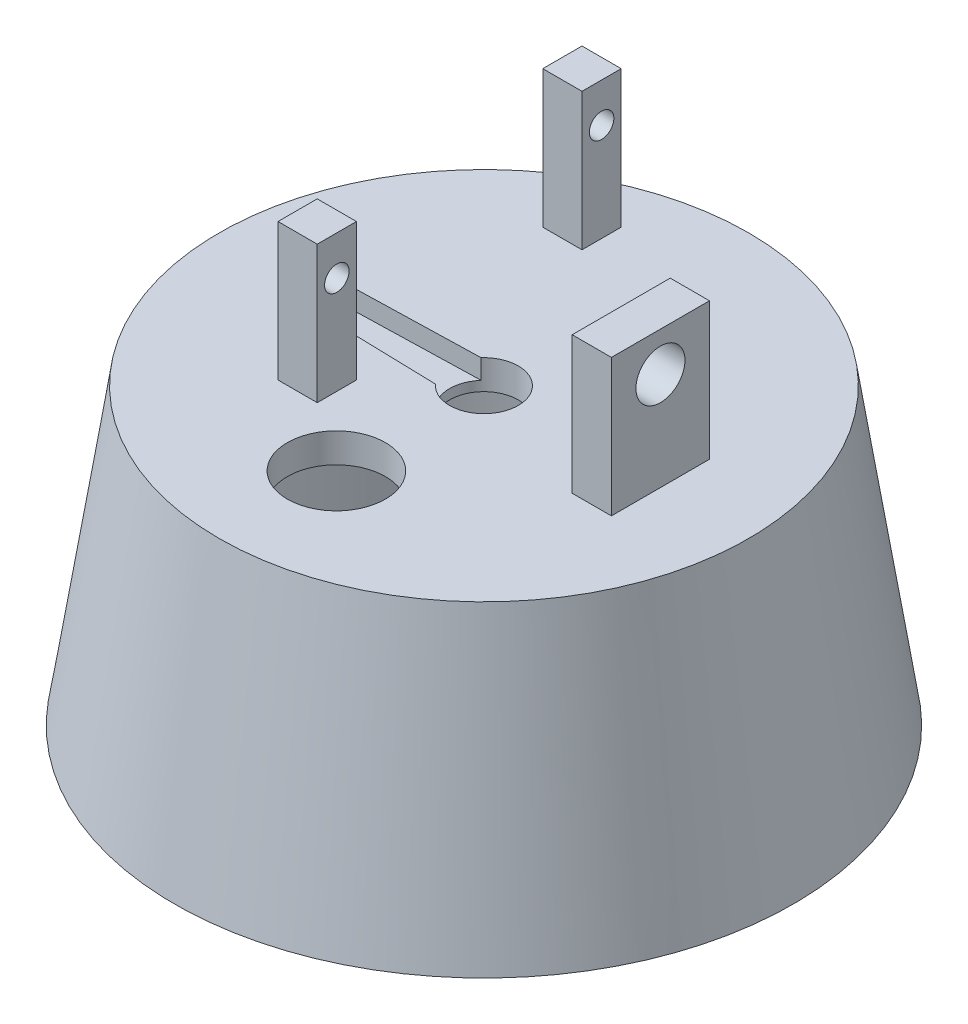
ISO-10303-21;
HEADER;
FILE_DESCRIPTION(('STEP AP214'),'2;1');
FILE_NAME('part.step','',(''),(''),'','','');
FILE_SCHEMA(('AUTOMOTIVE_DESIGN { 1 0 10303 214 1 1 1 1 }'));
ENDSEC;
DATA;
#1=APPLICATION_CONTEXT('core data for automotive mechanical design processes');
#2=APPLICATION_PROTOCOL_DEFINITION('international standard','automotive_design',2000,#1);
#3=PRODUCT_CONTEXT('',#1,'mechanical');
#4=PRODUCT('Part','Part','',(#3));
#5=PRODUCT_RELATED_PRODUCT_CATEGORY('part','',(#4));
#6=PRODUCT_DEFINITION_FORMATION('','',#4);
#7=PRODUCT_DEFINITION_CONTEXT('part definition',#1,'design');
#8=PRODUCT_DEFINITION('design','',#6,#7);
#9=PRODUCT_DEFINITION_SHAPE('','',#8);
#10=(LENGTH_UNIT() NAMED_UNIT(*) SI_UNIT(.MILLI.,.METRE.));
#11=(NAMED_UNIT(*) PLANE_ANGLE_UNIT() SI_UNIT($,.RADIAN.));
#12=(NAMED_UNIT(*) SI_UNIT($,.STERADIAN.) SOLID_ANGLE_UNIT());
#13=UNCERTAINTY_MEASURE_WITH_UNIT(LENGTH_MEASURE(1.E-05),#10,'distance_accuracy_value','');
#14=(GEOMETRIC_REPRESENTATION_CONTEXT(3) GLOBAL_UNCERTAINTY_ASSIGNED_CONTEXT((#13)) GLOBAL_UNIT_ASSIGNED_CONTEXT((#10,
#11,#12)) REPRESENTATION_CONTEXT('',''));
#15=CARTESIAN_POINT('',(0.,0.,0.));
#16=DIRECTION('',(0.,0.,1.));
#17=DIRECTION('',(1.,0.,0.));
#18=AXIS2_PLACEMENT_3D('',#15,#16,#17);
#19=CARTESIAN_POINT('',(0.,30.,0.));
#20=DIRECTION('',(0.,1.,0.));
#21=DIRECTION('',(0.,0.,1.));
#22=AXIS2_PLACEMENT_3D('',#19,#20,#21);
#23=PLANE('',#22);
#24=CARTESIAN_POINT('',(0.,30.,0.));
#25=DIRECTION('',(0.,1.,0.));
#26=DIRECTION('',(0.,0.,1.));
#27=AXIS2_PLACEMENT_3D('',#24,#25,#26);
#28=CIRCLE('',#27,3.5);
#29=CARTESIAN_POINT('',(-2.61064188469618,30.,2.3312119058271));
#30=VERTEX_POINT('',#29);
#31=CARTESIAN_POINT('',(-2.61075285255401,30.,-2.33108763088844));
#32=VERTEX_POINT('',#31);
#33=EDGE_CURVE('E194',#30,#32,#28,.T.);
#34=ORIENTED_EDGE('',*,*,#33,.F.);
#35=DIRECTION('',(0.999644381212083,0.,0.0266666666666665));
#36=VECTOR('',#35,1.);
#37=CARTESIAN_POINT('',(-0.0639999999999996,30.,2.399146514909));
#38=LINE('',#37,#36);
#39=CARTESIAN_POINT('',(-15.0533333333333,30.,1.99928876242417));
#40=VERTEX_POINT('',#39);
#41=EDGE_CURVE('E207',#40,#30,#38,.T.);
#42=ORIENTED_EDGE('',*,*,#41,.F.);
#43=CARTESIAN_POINT('',(-15.,30.,0.));
#44=DIRECTION('',(0.,1.,0.));
#45=DIRECTION('',(0.,0.,1.));
#46=AXIS2_PLACEMENT_3D('',#43,#44,#45);
#47=CIRCLE('',#46,2.);
#48=CARTESIAN_POINT('',(-15.,30.,-2.));
#49=VERTEX_POINT('',#48);
#50=EDGE_CURVE('E208',#49,#40,#47,.T.);
#51=ORIENTED_EDGE('',*,*,#50,.F.);
#52=DIRECTION('',(0.999643110687499,0.,-0.0267142519083337));
#53=VECTOR('',#52,1.);
#54=CARTESIAN_POINT('',(-0.0641142045800008,30.,-2.39914346565));
#55=LINE('',#54,#53);
#56=EDGE_CURVE('E71',#49,#32,#55,.T.);
#57=ORIENTED_EDGE('',*,*,#56,.T.);
#58=EDGE_LOOP('',(#34,#42,#51,#57));
#59=FACE_BOUND('',#58,.T.);
#60=CARTESIAN_POINT('',(0.,30.,15.0450566495924));
#61=DIRECTION('',(0.,1.,0.));
#62=DIRECTION('',(0.,0.,1.));
#63=AXIS2_PLACEMENT_3D('',#60,#61,#62);
#64=CIRCLE('',#63,5.);
#65=CARTESIAN_POINT('',(0.,30.,20.0450566495924));
#66=VERTEX_POINT('',#65);
#67=EDGE_CURVE('E212',#66,#66,#64,.T.);
#68=ORIENTED_EDGE('',*,*,#67,.F.);
#69=EDGE_LOOP('',(#68));
#70=FACE_BOUND('',#69,.T.);
#71=CARTESIAN_POINT('',(0.,30.,0.));
#72=DIRECTION('',(0.,-1.,0.));
#73=DIRECTION('',(0.,0.,-1.));
#74=AXIS2_PLACEMENT_3D('',#71,#72,#73);
#75=CIRCLE('',#74,27.);
#76=CARTESIAN_POINT('',(0.,30.,-27.));
#77=VERTEX_POINT('',#76);
#78=EDGE_CURVE('E355',#77,#77,#75,.T.);
#79=ORIENTED_EDGE('',*,*,#78,.F.);
#80=EDGE_LOOP('',(#79));
#81=FACE_BOUND('',#80,.T.);
#82=DIRECTION('',(-1.,0.,0.));
#83=VECTOR('',#82,1.);
#84=CARTESIAN_POINT('',(-7.,30.,-21.));
#85=LINE('',#84,#83);
#86=CARTESIAN_POINT('',(-7.,30.,-21.));
#87=VERTEX_POINT('',#86);
#88=CARTESIAN_POINT('',(-11.,30.,-21.));
#89=VERTEX_POINT('',#88);
#90=EDGE_CURVE('E333',#87,#89,#85,.T.);
#91=ORIENTED_EDGE('',*,*,#90,.F.);
#92=DIRECTION('',(0.,0.,-1.));
#93=VECTOR('',#92,1.);
#94=CARTESIAN_POINT('',(-7.,30.,-21.));
#95=LINE('',#94,#93);
#96=CARTESIAN_POINT('',(-7.,30.,-17.));
#97=VERTEX_POINT('',#96);
#98=EDGE_CURVE('E314',#97,#87,#95,.T.);
#99=ORIENTED_EDGE('',*,*,#98,.F.);
#100=DIRECTION('',(1.,0.,0.));
#101=VECTOR('',#100,1.);
#102=CARTESIAN_POINT('',(-7.,30.,-17.));
#103=LINE('',#102,#101);
#104=CARTESIAN_POINT('',(-11.,30.,-17.));
#105=VERTEX_POINT('',#104);
#106=EDGE_CURVE('E320',#105,#97,#103,.T.);
#107=ORIENTED_EDGE('',*,*,#106,.F.);
#108=DIRECTION('',(0.,0.,1.));
#109=VECTOR('',#108,1.);
#110=CARTESIAN_POINT('',(-11.,30.,-21.));
#111=LINE('',#110,#109);
#112=EDGE_CURVE('E336',#89,#105,#111,.T.);
#113=ORIENTED_EDGE('',*,*,#112,.F.);
#114=EDGE_LOOP('',(#91,#99,#107,#113));
#115=FACE_BOUND('',#114,.T.);
#116=DIRECTION('',(1.,0.,0.));
#117=VECTOR('',#116,1.);
#118=CARTESIAN_POINT('',(-11.,30.,10.));
#119=LINE('',#118,#117);
#120=CARTESIAN_POINT('',(-11.,30.,10.));
#121=VERTEX_POINT('',#120);
#122=CARTESIAN_POINT('',(-7.,30.,10.));
#123=VERTEX_POINT('',#122);
#124=EDGE_CURVE('E292',#121,#123,#119,.T.);
#125=ORIENTED_EDGE('',*,*,#124,.F.);
#126=DIRECTION('',(0.,0.,1.));
#127=VECTOR('',#126,1.);
#128=CARTESIAN_POINT('',(-11.,30.,6.));
#129=LINE('',#128,#127);
#130=CARTESIAN_POINT('',(-11.,30.,6.));
#131=VERTEX_POINT('',#130);
#132=EDGE_CURVE('E288',#131,#121,#129,.T.);
#133=ORIENTED_EDGE('',*,*,#132,.F.);
#134=DIRECTION('',(-1.,0.,0.));
#135=VECTOR('',#134,1.);
#136=CARTESIAN_POINT('',(-11.,30.,6.));
#137=LINE('',#136,#135);
#138=CARTESIAN_POINT('',(-7.,30.,6.));
#139=VERTEX_POINT('',#138);
#140=EDGE_CURVE('E278',#139,#131,#137,.T.);
#141=ORIENTED_EDGE('',*,*,#140,.F.);
#142=DIRECTION('',(0.,0.,-1.));
#143=VECTOR('',#142,1.);
#144=CARTESIAN_POINT('',(-7.,30.,6.));
#145=LINE('',#144,#143);
#146=EDGE_CURVE('E295',#123,#139,#145,.T.);
#147=ORIENTED_EDGE('',*,*,#146,.F.);
#148=EDGE_LOOP('',(#125,#133,#141,#147));
#149=FACE_BOUND('',#148,.T.);
#150=DIRECTION('',(-1.,0.,0.));
#151=VECTOR('',#150,1.);
#152=CARTESIAN_POINT('',(14.,30.,-5.));
#153=LINE('',#152,#151);
#154=CARTESIAN_POINT('',(18.,30.,-5.));
#155=VERTEX_POINT('',#154);
#156=CARTESIAN_POINT('',(14.,30.,-5.));
#157=VERTEX_POINT('',#156);
#158=EDGE_CURVE('E240',#155,#157,#153,.T.);
#159=ORIENTED_EDGE('',*,*,#158,.F.);
#160=DIRECTION('',(0.,0.,-1.));
#161=VECTOR('',#160,1.);
#162=CARTESIAN_POINT('',(18.,30.,5.));
#163=LINE('',#162,#161);
#164=CARTESIAN_POINT('',(18.,30.,5.));
#165=VERTEX_POINT('',#164);
#166=EDGE_CURVE('E236',#165,#155,#163,.T.);
#167=ORIENTED_EDGE('',*,*,#166,.F.);
#168=DIRECTION('',(1.,0.,0.));
#169=VECTOR('',#168,1.);
#170=CARTESIAN_POINT('',(14.,30.,5.));
#171=LINE('',#170,#169);
#172=CARTESIAN_POINT('',(14.,30.,5.));
#173=VERTEX_POINT('',#172);
#174=EDGE_CURVE('E226',#173,#165,#171,.T.);
#175=ORIENTED_EDGE('',*,*,#174,.F.);
#176=DIRECTION('',(0.,0.,1.));
#177=VECTOR('',#176,1.);
#178=CARTESIAN_POINT('',(14.,30.,5.));
#179=LINE('',#178,#177);
#180=EDGE_CURVE('E243',#157,#173,#179,.T.);
#181=ORIENTED_EDGE('',*,*,#180,.F.);
#182=EDGE_LOOP('',(#159,#167,#175,#181));
#183=FACE_BOUND('',#182,.T.);
#184=ADVANCED_FACE('F53',(#59,#70,#81,#115,#149,#183),#23,.T.);
#185=CARTESIAN_POINT('',(0.,0.,0.));
#186=DIRECTION('',(0.,1.,0.));
#187=DIRECTION('',(0.,0.,1.));
#188=AXIS2_PLACEMENT_3D('',#185,#186,#187);
#189=PLANE('',#188);
#190=CARTESIAN_POINT('',(0.,0.,0.));
#191=DIRECTION('',(0.,1.,0.));
#192=DIRECTION('',(0.,0.,1.));
#193=AXIS2_PLACEMENT_3D('',#190,#191,#192);
#194=CIRCLE('',#193,25.25);
#195=CARTESIAN_POINT('',(0.,0.,25.25));
#196=VERTEX_POINT('',#195);
#197=EDGE_CURVE('E12',#196,#196,#194,.T.);
#198=ORIENTED_EDGE('',*,*,#197,.T.);
#199=EDGE_LOOP('',(#198));
#200=FACE_BOUND('',#199,.T.);
#201=CARTESIAN_POINT('',(0.,0.,0.));
#202=DIRECTION('',(0.,-1.,0.));
#203=DIRECTION('',(0.,0.,-1.));
#204=AXIS2_PLACEMENT_3D('',#201,#202,#203);
#205=CIRCLE('',#204,31.5640277877834);
#206=CARTESIAN_POINT('',(0.,0.,-31.5640277877834));
#207=VERTEX_POINT('',#206);
#208=EDGE_CURVE('E359',#207,#207,#205,.T.);
#209=ORIENTED_EDGE('',*,*,#208,.T.);
#210=EDGE_LOOP('',(#209));
#211=FACE_BOUND('',#210,.T.);
#212=ADVANCED_FACE('F55',(#200,#211),#189,.F.);
#213=CARTESIAN_POINT('',(0.,27.,0.));
#214=DIRECTION('',(0.,-1.,0.));
#215=DIRECTION('',(0.,0.,-1.));
#216=AXIS2_PLACEMENT_3D('',#213,#214,#215);
#217=CYLINDRICAL_SURFACE('',#216,25.25);
#218=CARTESIAN_POINT('',(0.,27.,0.));
#219=DIRECTION('',(0.,1.,0.));
#220=DIRECTION('',(0.,0.,1.));
#221=AXIS2_PLACEMENT_3D('',#218,#219,#220);
#222=CIRCLE('',#221,25.25);
#223=CARTESIAN_POINT('',(0.,27.,25.25));
#224=VERTEX_POINT('',#223);
#225=EDGE_CURVE('E63',#224,#224,#222,.T.);
#226=ORIENTED_EDGE('',*,*,#225,.T.);
#227=EDGE_LOOP('',(#226));
#228=FACE_BOUND('',#227,.T.);
#229=ORIENTED_EDGE('',*,*,#197,.F.);
#230=EDGE_LOOP('',(#229));
#231=FACE_BOUND('',#230,.T.);
#232=ADVANCED_FACE('F400',(#228,#231),#217,.F.);
#233=CARTESIAN_POINT('',(0.,27.,0.));
#234=DIRECTION('',(0.,1.,0.));
#235=DIRECTION('',(0.,0.,1.));
#236=AXIS2_PLACEMENT_3D('',#233,#234,#235);
#237=PLANE('',#236);
#238=CARTESIAN_POINT('',(0.,27.,0.));
#239=DIRECTION('',(0.,1.,0.));
#240=DIRECTION('',(0.,0.,1.));
#241=AXIS2_PLACEMENT_3D('',#238,#239,#240);
#242=CIRCLE('',#241,3.5);
#243=CARTESIAN_POINT('',(0.,27.,3.5));
#244=VERTEX_POINT('',#243);
#245=EDGE_CURVE('E181',#244,#244,#242,.T.);
#246=ORIENTED_EDGE('',*,*,#245,.T.);
#247=EDGE_LOOP('',(#246));
#248=FACE_BOUND('',#247,.T.);
#249=CARTESIAN_POINT('',(0.,27.,15.0450566495924));
#250=DIRECTION('',(0.,1.,0.));
#251=DIRECTION('',(0.,0.,1.));
#252=AXIS2_PLACEMENT_3D('',#249,#250,#251);
#253=CIRCLE('',#252,5.);
#254=CARTESIAN_POINT('',(0.,27.,20.0450566495924));
#255=VERTEX_POINT('',#254);
#256=EDGE_CURVE('E57',#255,#255,#253,.T.);
#257=ORIENTED_EDGE('',*,*,#256,.T.);
#258=EDGE_LOOP('',(#257));
#259=FACE_BOUND('',#258,.T.);
#260=ORIENTED_EDGE('',*,*,#225,.F.);
#261=EDGE_LOOP('',(#260));
#262=FACE_BOUND('',#261,.T.);
#263=ADVANCED_FACE('F407',(#248,#259,#262),#237,.F.);
#264=CARTESIAN_POINT('',(0.,0.,0.));
#265=DIRECTION('',(0.,-1.,0.));
#266=DIRECTION('',(0.,0.,-1.));
#267=AXIS2_PLACEMENT_3D('',#264,#265,#266);
#268=CONICAL_SURFACE('',#267,31.5640277877834,0.15097658671051);
#269=ORIENTED_EDGE('',*,*,#78,.T.);
#270=EDGE_LOOP('',(#269));
#271=FACE_BOUND('',#270,.T.);
#272=ORIENTED_EDGE('',*,*,#208,.F.);
#273=EDGE_LOOP('',(#272));
#274=FACE_BOUND('',#273,.T.);
#275=ADVANCED_FACE('F405',(#271,#274),#268,.T.);
#276=CARTESIAN_POINT('',(-7.,44.,-21.));
#277=DIRECTION('',(-1.,0.,0.));
#278=DIRECTION('',(0.,0.,1.));
#279=AXIS2_PLACEMENT_3D('',#276,#277,#278);
#280=PLANE('',#279);
#281=CARTESIAN_POINT('',(-7.,40.,-19.));
#282=DIRECTION('',(1.,0.,0.));
#283=DIRECTION('',(0.,0.,-1.));
#284=AXIS2_PLACEMENT_3D('',#281,#282,#283);
#285=CIRCLE('',#284,1.25);
#286=CARTESIAN_POINT('',(-7.,40.,-20.25));
#287=VERTEX_POINT('',#286);
#288=EDGE_CURVE('E260',#287,#287,#285,.T.);
#289=ORIENTED_EDGE('',*,*,#288,.F.);
#290=EDGE_LOOP('',(#289));
#291=FACE_BOUND('',#290,.T.);
#292=ORIENTED_EDGE('',*,*,#98,.T.);
#293=DIRECTION('',(0.,-1.,0.));
#294=VECTOR('',#293,1.);
#295=CARTESIAN_POINT('',(-7.,44.,-21.));
#296=LINE('',#295,#294);
#297=CARTESIAN_POINT('',(-7.,44.,-21.));
#298=VERTEX_POINT('',#297);
#299=EDGE_CURVE('E352',#298,#87,#296,.T.);
#300=ORIENTED_EDGE('',*,*,#299,.F.);
#301=DIRECTION('',(0.,0.,-1.));
#302=VECTOR('',#301,1.);
#303=CARTESIAN_POINT('',(-7.,44.,-21.));
#304=LINE('',#303,#302);
#305=CARTESIAN_POINT('',(-7.,44.,-17.));
#306=VERTEX_POINT('',#305);
#307=EDGE_CURVE('E315',#306,#298,#304,.T.);
#308=ORIENTED_EDGE('',*,*,#307,.F.);
#309=DIRECTION('',(0.,-1.,0.));
#310=VECTOR('',#309,1.);
#311=CARTESIAN_POINT('',(-7.,44.,-17.));
#312=LINE('',#311,#310);
#313=EDGE_CURVE('E329',#306,#97,#312,.T.);
#314=ORIENTED_EDGE('',*,*,#313,.T.);
#315=EDGE_LOOP('',(#292,#300,#308,#314));
#316=FACE_BOUND('',#315,.T.);
#317=ADVANCED_FACE('F422',(#291,#316),#280,.F.);
#318=CARTESIAN_POINT('',(-7.,44.,-21.));
#319=DIRECTION('',(0.,0.,1.));
#320=DIRECTION('',(1.,0.,0.));
#321=AXIS2_PLACEMENT_3D('',#318,#319,#320);
#322=PLANE('',#321);
#323=ORIENTED_EDGE('',*,*,#90,.T.);
#324=DIRECTION('',(0.,-1.,0.));
#325=VECTOR('',#324,1.);
#326=CARTESIAN_POINT('',(-11.,44.,-21.));
#327=LINE('',#326,#325);
#328=CARTESIAN_POINT('',(-11.,44.,-21.));
#329=VERTEX_POINT('',#328);
#330=EDGE_CURVE('E348',#329,#89,#327,.T.);
#331=ORIENTED_EDGE('',*,*,#330,.F.);
#332=DIRECTION('',(-1.,0.,0.));
#333=VECTOR('',#332,1.);
#334=CARTESIAN_POINT('',(-7.,44.,-21.));
#335=LINE('',#334,#333);
#336=EDGE_CURVE('E319',#298,#329,#335,.T.);
#337=ORIENTED_EDGE('',*,*,#336,.F.);
#338=ORIENTED_EDGE('',*,*,#299,.T.);
#339=EDGE_LOOP('',(#323,#331,#337,#338));
#340=FACE_BOUND('',#339,.T.);
#341=ADVANCED_FACE('F427',(#340),#322,.F.);
#342=CARTESIAN_POINT('',(-11.,44.,-21.));
#343=DIRECTION('',(1.,0.,0.));
#344=DIRECTION('',(0.,0.,-1.));
#345=AXIS2_PLACEMENT_3D('',#342,#343,#344);
#346=PLANE('',#345);
#347=CARTESIAN_POINT('',(-11.,40.,-19.));
#348=DIRECTION('',(1.,0.,0.));
#349=DIRECTION('',(0.,0.,-1.));
#350=AXIS2_PLACEMENT_3D('',#347,#348,#349);
#351=CIRCLE('',#350,1.25);
#352=CARTESIAN_POINT('',(-11.,40.,-20.25));
#353=VERTEX_POINT('',#352);
#354=EDGE_CURVE('E272',#353,#353,#351,.T.);
#355=ORIENTED_EDGE('',*,*,#354,.T.);
#356=EDGE_LOOP('',(#355));
#357=FACE_BOUND('',#356,.T.);
#358=ORIENTED_EDGE('',*,*,#112,.T.);
#359=DIRECTION('',(0.,-1.,0.));
#360=VECTOR('',#359,1.);
#361=CARTESIAN_POINT('',(-11.,44.,-17.));
#362=LINE('',#361,#360);
#363=CARTESIAN_POINT('',(-11.,44.,-17.));
#364=VERTEX_POINT('',#363);
#365=EDGE_CURVE('E345',#364,#105,#362,.T.);
#366=ORIENTED_EDGE('',*,*,#365,.F.);
#367=DIRECTION('',(0.,0.,1.));
#368=VECTOR('',#367,1.);
#369=CARTESIAN_POINT('',(-11.,44.,-21.));
#370=LINE('',#369,#368);
#371=EDGE_CURVE('E323',#329,#364,#370,.T.);
#372=ORIENTED_EDGE('',*,*,#371,.F.);
#373=ORIENTED_EDGE('',*,*,#330,.T.);
#374=EDGE_LOOP('',(#358,#366,#372,#373));
#375=FACE_BOUND('',#374,.T.);
#376=ADVANCED_FACE('F500',(#357,#375),#346,.F.);
#377=CARTESIAN_POINT('',(-7.,44.,-17.));
#378=DIRECTION('',(0.,0.,-1.));
#379=DIRECTION('',(-1.,0.,0.));
#380=AXIS2_PLACEMENT_3D('',#377,#378,#379);
#381=PLANE('',#380);
#382=ORIENTED_EDGE('',*,*,#106,.T.);
#383=ORIENTED_EDGE('',*,*,#313,.F.);
#384=DIRECTION('',(1.,0.,0.));
#385=VECTOR('',#384,1.);
#386=CARTESIAN_POINT('',(-7.,44.,-17.));
#387=LINE('',#386,#385);
#388=EDGE_CURVE('E326',#364,#306,#387,.T.);
#389=ORIENTED_EDGE('',*,*,#388,.F.);
#390=ORIENTED_EDGE('',*,*,#365,.T.);
#391=EDGE_LOOP('',(#382,#383,#389,#390));
#392=FACE_BOUND('',#391,.T.);
#393=ADVANCED_FACE('F496',(#392),#381,.F.);
#394=CARTESIAN_POINT('',(0.,44.,0.));
#395=DIRECTION('',(0.,-1.,0.));
#396=DIRECTION('',(0.,0.,-1.));
#397=AXIS2_PLACEMENT_3D('',#394,#395,#396);
#398=PLANE('',#397);
#399=ORIENTED_EDGE('',*,*,#307,.T.);
#400=ORIENTED_EDGE('',*,*,#336,.T.);
#401=ORIENTED_EDGE('',*,*,#371,.T.);
#402=ORIENTED_EDGE('',*,*,#388,.T.);
#403=EDGE_LOOP('',(#399,#400,#401,#402));
#404=FACE_BOUND('',#403,.T.);
#405=ADVANCED_FACE('F492',(#404),#398,.F.);
#406=CARTESIAN_POINT('',(-11.,44.,6.));
#407=DIRECTION('',(1.,0.,0.));
#408=DIRECTION('',(0.,0.,-1.));
#409=AXIS2_PLACEMENT_3D('',#406,#407,#408);
#410=PLANE('',#409);
#411=CARTESIAN_POINT('',(-11.,40.,8.));
#412=DIRECTION('',(1.,0.,0.));
#413=DIRECTION('',(0.,0.,-1.));
#414=AXIS2_PLACEMENT_3D('',#411,#412,#413);
#415=CIRCLE('',#414,1.25);
#416=CARTESIAN_POINT('',(-11.,40.,6.75));
#417=VERTEX_POINT('',#416);
#418=EDGE_CURVE('E265',#417,#417,#415,.T.);
#419=ORIENTED_EDGE('',*,*,#418,.T.);
#420=EDGE_LOOP('',(#419));
#421=FACE_BOUND('',#420,.T.);
#422=ORIENTED_EDGE('',*,*,#132,.T.);
#423=DIRECTION('',(0.,-1.,0.));
#424=VECTOR('',#423,1.);
#425=CARTESIAN_POINT('',(-11.,44.,10.));
#426=LINE('',#425,#424);
#427=CARTESIAN_POINT('',(-11.,44.,10.));
#428=VERTEX_POINT('',#427);
#429=EDGE_CURVE('E311',#428,#121,#426,.T.);
#430=ORIENTED_EDGE('',*,*,#429,.F.);
#431=DIRECTION('',(0.,0.,1.));
#432=VECTOR('',#431,1.);
#433=CARTESIAN_POINT('',(-11.,44.,6.));
#434=LINE('',#433,#432);
#435=CARTESIAN_POINT('',(-11.,44.,6.));
#436=VERTEX_POINT('',#435);
#437=EDGE_CURVE('E273',#436,#428,#434,.T.);
#438=ORIENTED_EDGE('',*,*,#437,.F.);
#439=DIRECTION('',(0.,-1.,0.));
#440=VECTOR('',#439,1.);
#441=CARTESIAN_POINT('',(-11.,44.,6.));
#442=LINE('',#441,#440);
#443=EDGE_CURVE('E287',#436,#131,#442,.T.);
#444=ORIENTED_EDGE('',*,*,#443,.T.);
#445=EDGE_LOOP('',(#422,#430,#438,#444));
#446=FACE_BOUND('',#445,.T.);
#447=ADVANCED_FACE('F488',(#421,#446),#410,.F.);
#448=CARTESIAN_POINT('',(-11.,44.,10.));
#449=DIRECTION('',(0.,0.,-1.));
#450=DIRECTION('',(-1.,0.,0.));
#451=AXIS2_PLACEMENT_3D('',#448,#449,#450);
#452=PLANE('',#451);
#453=ORIENTED_EDGE('',*,*,#124,.T.);
#454=DIRECTION('',(0.,-1.,0.));
#455=VECTOR('',#454,1.);
#456=CARTESIAN_POINT('',(-7.,44.,10.));
#457=LINE('',#456,#455);
#458=CARTESIAN_POINT('',(-7.,44.,10.));
#459=VERTEX_POINT('',#458);
#460=EDGE_CURVE('E307',#459,#123,#457,.T.);
#461=ORIENTED_EDGE('',*,*,#460,.F.);
#462=DIRECTION('',(1.,0.,0.));
#463=VECTOR('',#462,1.);
#464=CARTESIAN_POINT('',(-11.,44.,10.));
#465=LINE('',#464,#463);
#466=EDGE_CURVE('E277',#428,#459,#465,.T.);
#467=ORIENTED_EDGE('',*,*,#466,.F.);
#468=ORIENTED_EDGE('',*,*,#429,.T.);
#469=EDGE_LOOP('',(#453,#461,#467,#468));
#470=FACE_BOUND('',#469,.T.);
#471=ADVANCED_FACE('F484',(#470),#452,.F.);
#472=CARTESIAN_POINT('',(-7.,44.,6.));
#473=DIRECTION('',(-1.,0.,0.));
#474=DIRECTION('',(0.,0.,1.));
#475=AXIS2_PLACEMENT_3D('',#472,#473,#474);
#476=PLANE('',#475);
#477=CARTESIAN_POINT('',(-7.,40.,8.));
#478=DIRECTION('',(1.,0.,0.));
#479=DIRECTION('',(0.,0.,-1.));
#480=AXIS2_PLACEMENT_3D('',#477,#478,#479);
#481=CIRCLE('',#480,1.25);
#482=CARTESIAN_POINT('',(-7.,40.,6.75));
#483=VERTEX_POINT('',#482);
#484=EDGE_CURVE('E261',#483,#483,#481,.T.);
#485=ORIENTED_EDGE('',*,*,#484,.F.);
#486=EDGE_LOOP('',(#485));
#487=FACE_BOUND('',#486,.T.);
#488=ORIENTED_EDGE('',*,*,#146,.T.);
#489=DIRECTION('',(0.,-1.,0.));
#490=VECTOR('',#489,1.);
#491=CARTESIAN_POINT('',(-7.,44.,6.));
#492=LINE('',#491,#490);
#493=CARTESIAN_POINT('',(-7.,44.,6.));
#494=VERTEX_POINT('',#493);
#495=EDGE_CURVE('E304',#494,#139,#492,.T.);
#496=ORIENTED_EDGE('',*,*,#495,.F.);
#497=DIRECTION('',(0.,0.,-1.));
#498=VECTOR('',#497,1.);
#499=CARTESIAN_POINT('',(-7.,44.,6.));
#500=LINE('',#499,#498);
#501=EDGE_CURVE('E281',#459,#494,#500,.T.);
#502=ORIENTED_EDGE('',*,*,#501,.F.);
#503=ORIENTED_EDGE('',*,*,#460,.T.);
#504=EDGE_LOOP('',(#488,#496,#502,#503));
#505=FACE_BOUND('',#504,.T.);
#506=ADVANCED_FACE('F480',(#487,#505),#476,.F.);
#507=CARTESIAN_POINT('',(-11.,44.,6.));
#508=DIRECTION('',(0.,0.,1.));
#509=DIRECTION('',(1.,0.,0.));
#510=AXIS2_PLACEMENT_3D('',#507,#508,#509);
#511=PLANE('',#510);
#512=ORIENTED_EDGE('',*,*,#140,.T.);
#513=ORIENTED_EDGE('',*,*,#443,.F.);
#514=DIRECTION('',(-1.,0.,0.));
#515=VECTOR('',#514,1.);
#516=CARTESIAN_POINT('',(-11.,44.,6.));
#517=LINE('',#516,#515);
#518=EDGE_CURVE('E284',#494,#436,#517,.T.);
#519=ORIENTED_EDGE('',*,*,#518,.F.);
#520=ORIENTED_EDGE('',*,*,#495,.T.);
#521=EDGE_LOOP('',(#512,#513,#519,#520));
#522=FACE_BOUND('',#521,.T.);
#523=ADVANCED_FACE('F476',(#522),#511,.F.);
#524=CARTESIAN_POINT('',(0.,44.,0.));
#525=DIRECTION('',(0.,1.,0.));
#526=DIRECTION('',(0.,0.,1.));
#527=AXIS2_PLACEMENT_3D('',#524,#525,#526);
#528=PLANE('',#527);
#529=ORIENTED_EDGE('',*,*,#437,.T.);
#530=ORIENTED_EDGE('',*,*,#466,.T.);
#531=ORIENTED_EDGE('',*,*,#501,.T.);
#532=ORIENTED_EDGE('',*,*,#518,.T.);
#533=EDGE_LOOP('',(#529,#530,#531,#532));
#534=FACE_BOUND('',#533,.T.);
#535=ADVANCED_FACE('F469',(#534),#528,.T.);
#536=CARTESIAN_POINT('',(-21.,40.,8.));
#537=DIRECTION('',(1.,0.,0.));
#538=DIRECTION('',(0.,0.,-1.));
#539=AXIS2_PLACEMENT_3D('',#536,#537,#538);
#540=CYLINDRICAL_SURFACE('',#539,1.25);
#541=ORIENTED_EDGE('',*,*,#484,.T.);
#542=EDGE_LOOP('',(#541));
#543=FACE_BOUND('',#542,.T.);
#544=ORIENTED_EDGE('',*,*,#418,.F.);
#545=EDGE_LOOP('',(#544));
#546=FACE_BOUND('',#545,.T.);
#547=ADVANCED_FACE('F466',(#543,#546),#540,.F.);
#548=CARTESIAN_POINT('',(-21.,40.,-19.));
#549=DIRECTION('',(1.,0.,0.));
#550=DIRECTION('',(0.,0.,-1.));
#551=AXIS2_PLACEMENT_3D('',#548,#549,#550);
#552=CYLINDRICAL_SURFACE('',#551,1.25);
#553=ORIENTED_EDGE('',*,*,#288,.T.);
#554=EDGE_LOOP('',(#553));
#555=FACE_BOUND('',#554,.T.);
#556=ORIENTED_EDGE('',*,*,#354,.F.);
#557=EDGE_LOOP('',(#556));
#558=FACE_BOUND('',#557,.T.);
#559=ADVANCED_FACE('F464',(#555,#558),#552,.F.);
#560=CARTESIAN_POINT('',(18.,44.,5.));
#561=DIRECTION('',(-1.,0.,0.));
#562=DIRECTION('',(0.,0.,1.));
#563=AXIS2_PLACEMENT_3D('',#560,#561,#562);
#564=PLANE('',#563);
#565=CARTESIAN_POINT('',(18.,40.,0.));
#566=DIRECTION('',(1.,0.,0.));
#567=DIRECTION('',(0.,0.,-1.));
#568=AXIS2_PLACEMENT_3D('',#565,#566,#567);
#569=CIRCLE('',#568,2.5);
#570=CARTESIAN_POINT('',(18.,40.,-2.5));
#571=VERTEX_POINT('',#570);
#572=EDGE_CURVE('E216',#571,#571,#569,.T.);
#573=ORIENTED_EDGE('',*,*,#572,.F.);
#574=EDGE_LOOP('',(#573));
#575=FACE_BOUND('',#574,.T.);
#576=ORIENTED_EDGE('',*,*,#166,.T.);
#577=DIRECTION('',(0.,-1.,0.));
#578=VECTOR('',#577,1.);
#579=CARTESIAN_POINT('',(18.,44.,-5.));
#580=LINE('',#579,#578);
#581=CARTESIAN_POINT('',(18.,44.,-5.));
#582=VERTEX_POINT('',#581);
#583=EDGE_CURVE('E257',#582,#155,#580,.T.);
#584=ORIENTED_EDGE('',*,*,#583,.F.);
#585=DIRECTION('',(0.,0.,-1.));
#586=VECTOR('',#585,1.);
#587=CARTESIAN_POINT('',(18.,44.,5.));
#588=LINE('',#587,#586);
#589=CARTESIAN_POINT('',(18.,44.,5.));
#590=VERTEX_POINT('',#589);
#591=EDGE_CURVE('E221',#590,#582,#588,.T.);
#592=ORIENTED_EDGE('',*,*,#591,.F.);
#593=DIRECTION('',(0.,-1.,0.));
#594=VECTOR('',#593,1.);
#595=CARTESIAN_POINT('',(18.,44.,5.));
#596=LINE('',#595,#594);
#597=EDGE_CURVE('E235',#590,#165,#596,.T.);
#598=ORIENTED_EDGE('',*,*,#597,.T.);
#599=EDGE_LOOP('',(#576,#584,#592,#598));
#600=FACE_BOUND('',#599,.T.);
#601=ADVANCED_FACE('F452',(#575,#600),#564,.F.);
#602=CARTESIAN_POINT('',(14.,44.,-5.));
#603=DIRECTION('',(0.,0.,1.));
#604=DIRECTION('',(1.,0.,0.));
#605=AXIS2_PLACEMENT_3D('',#602,#603,#604);
#606=PLANE('',#605);
#607=ORIENTED_EDGE('',*,*,#158,.T.);
#608=DIRECTION('',(0.,-1.,0.));
#609=VECTOR('',#608,1.);
#610=CARTESIAN_POINT('',(14.,44.,-5.));
#611=LINE('',#610,#609);
#612=CARTESIAN_POINT('',(14.,44.,-5.));
#613=VERTEX_POINT('',#612);
#614=EDGE_CURVE('E253',#613,#157,#611,.T.);
#615=ORIENTED_EDGE('',*,*,#614,.F.);
#616=DIRECTION('',(-1.,0.,0.));
#617=VECTOR('',#616,1.);
#618=CARTESIAN_POINT('',(14.,44.,-5.));
#619=LINE('',#618,#617);
#620=EDGE_CURVE('E225',#582,#613,#619,.T.);
#621=ORIENTED_EDGE('',*,*,#620,.F.);
#622=ORIENTED_EDGE('',*,*,#583,.T.);
#623=EDGE_LOOP('',(#607,#615,#621,#622));
#624=FACE_BOUND('',#623,.T.);
#625=ADVANCED_FACE('F446',(#624),#606,.F.);
#626=CARTESIAN_POINT('',(14.,44.,5.));
#627=DIRECTION('',(1.,0.,0.));
#628=DIRECTION('',(0.,0.,-1.));
#629=AXIS2_PLACEMENT_3D('',#626,#627,#628);
#630=PLANE('',#629);
#631=CARTESIAN_POINT('',(14.,40.,0.));
#632=DIRECTION('',(1.,0.,0.));
#633=DIRECTION('',(0.,0.,-1.));
#634=AXIS2_PLACEMENT_3D('',#631,#632,#633);
#635=CIRCLE('',#634,2.5);
#636=CARTESIAN_POINT('',(14.,40.,-2.5));
#637=VERTEX_POINT('',#636);
#638=EDGE_CURVE('E220',#637,#637,#635,.T.);
#639=ORIENTED_EDGE('',*,*,#638,.T.);
#640=EDGE_LOOP('',(#639));
#641=FACE_BOUND('',#640,.T.);
#642=ORIENTED_EDGE('',*,*,#180,.T.);
#643=DIRECTION('',(0.,-1.,0.));
#644=VECTOR('',#643,1.);
#645=CARTESIAN_POINT('',(14.,44.,5.));
#646=LINE('',#645,#644);
#647=CARTESIAN_POINT('',(14.,44.,5.));
#648=VERTEX_POINT('',#647);
#649=EDGE_CURVE('E79',#648,#173,#646,.T.);
#650=ORIENTED_EDGE('',*,*,#649,.F.);
#651=DIRECTION('',(0.,0.,1.));
#652=VECTOR('',#651,1.);
#653=CARTESIAN_POINT('',(14.,44.,5.));
#654=LINE('',#653,#652);
#655=EDGE_CURVE('E229',#613,#648,#654,.T.);
#656=ORIENTED_EDGE('',*,*,#655,.F.);
#657=ORIENTED_EDGE('',*,*,#614,.T.);
#658=EDGE_LOOP('',(#642,#650,#656,#657));
#659=FACE_BOUND('',#658,.T.);
#660=ADVANCED_FACE('F372',(#641,#659),#630,.F.);
#661=CARTESIAN_POINT('',(14.,44.,5.));
#662=DIRECTION('',(0.,0.,-1.));
#663=DIRECTION('',(-1.,0.,0.));
#664=AXIS2_PLACEMENT_3D('',#661,#662,#663);
#665=PLANE('',#664);
#666=ORIENTED_EDGE('',*,*,#174,.T.);
#667=ORIENTED_EDGE('',*,*,#597,.F.);
#668=DIRECTION('',(1.,0.,0.));
#669=VECTOR('',#668,1.);
#670=CARTESIAN_POINT('',(14.,44.,5.));
#671=LINE('',#670,#669);
#672=EDGE_CURVE('E232',#648,#590,#671,.T.);
#673=ORIENTED_EDGE('',*,*,#672,.F.);
#674=ORIENTED_EDGE('',*,*,#649,.T.);
#675=EDGE_LOOP('',(#666,#667,#673,#674));
#676=FACE_BOUND('',#675,.T.);
#677=ADVANCED_FACE('F389',(#676),#665,.F.);
#678=CARTESIAN_POINT('',(0.,44.,0.));
#679=DIRECTION('',(0.,-1.,0.));
#680=DIRECTION('',(0.,0.,-1.));
#681=AXIS2_PLACEMENT_3D('',#678,#679,#680);
#682=PLANE('',#681);
#683=ORIENTED_EDGE('',*,*,#591,.T.);
#684=ORIENTED_EDGE('',*,*,#620,.T.);
#685=ORIENTED_EDGE('',*,*,#655,.T.);
#686=ORIENTED_EDGE('',*,*,#672,.T.);
#687=EDGE_LOOP('',(#683,#684,#685,#686));
#688=FACE_BOUND('',#687,.T.);
#689=ADVANCED_FACE('F378',(#688),#682,.F.);
#690=CARTESIAN_POINT('',(3.99999999999999,40.,0.));
#691=DIRECTION('',(1.,0.,0.));
#692=DIRECTION('',(0.,0.,-1.));
#693=AXIS2_PLACEMENT_3D('',#690,#691,#692);
#694=CYLINDRICAL_SURFACE('',#693,2.5);
#695=ORIENTED_EDGE('',*,*,#572,.T.);
#696=EDGE_LOOP('',(#695));
#697=FACE_BOUND('',#696,.T.);
#698=ORIENTED_EDGE('',*,*,#638,.F.);
#699=EDGE_LOOP('',(#698));
#700=FACE_BOUND('',#699,.T.);
#701=ADVANCED_FACE('F375',(#697,#700),#694,.F.);
#702=CARTESIAN_POINT('',(0.,16.,15.0450566495924));
#703=DIRECTION('',(0.,1.,0.));
#704=DIRECTION('',(0.,0.,1.));
#705=AXIS2_PLACEMENT_3D('',#702,#703,#704);
#706=CYLINDRICAL_SURFACE('',#705,5.);
#707=ORIENTED_EDGE('',*,*,#67,.T.);
#708=EDGE_LOOP('',(#707));
#709=FACE_BOUND('',#708,.T.);
#710=ORIENTED_EDGE('',*,*,#256,.F.);
#711=EDGE_LOOP('',(#710));
#712=FACE_BOUND('',#711,.T.);
#713=ADVANCED_FACE('F377',(#709,#712),#706,.F.);
#714=CARTESIAN_POINT('',(-0.0639999999999996,28.,2.399146514909));
#715=DIRECTION('',(-0.0266666666666665,0.,0.999644381212083));
#716=DIRECTION('',(0.999644381212083,0.,0.0266666666666665));
#717=AXIS2_PLACEMENT_3D('',#714,#715,#716);
#718=PLANE('',#717);
#719=ORIENTED_EDGE('',*,*,#41,.T.);
#720=DIRECTION('',(0.,1.,0.));
#721=VECTOR('',#720,1.);
#722=CARTESIAN_POINT('',(-2.61064188469618,28.,2.3312119058271));
#723=LINE('',#722,#721);
#724=CARTESIAN_POINT('',(-2.61064188469618,28.,2.3312119058271));
#725=VERTEX_POINT('',#724);
#726=EDGE_CURVE('E189',#725,#30,#723,.T.);
#727=ORIENTED_EDGE('',*,*,#726,.F.);
#728=DIRECTION('',(0.999644381212083,0.,0.0266666666666665));
#729=VECTOR('',#728,1.);
#730=CARTESIAN_POINT('',(-0.0639999999999996,28.,2.399146514909));
#731=LINE('',#730,#729);
#732=CARTESIAN_POINT('',(-15.0533333333333,28.,1.99928876242417));
#733=VERTEX_POINT('',#732);
#734=EDGE_CURVE('E176',#733,#725,#731,.T.);
#735=ORIENTED_EDGE('',*,*,#734,.F.);
#736=DIRECTION('',(0.,1.,0.));
#737=VECTOR('',#736,1.);
#738=CARTESIAN_POINT('',(-15.0533333333333,28.,1.99928876242417));
#739=LINE('',#738,#737);
#740=EDGE_CURVE('E199',#733,#40,#739,.T.);
#741=ORIENTED_EDGE('',*,*,#740,.T.);
#742=EDGE_LOOP('',(#719,#727,#735,#741));
#743=FACE_BOUND('',#742,.T.);
#744=ADVANCED_FACE('F385',(#743),#718,.F.);
#745=CARTESIAN_POINT('',(-0.0641142045800008,28.,-2.39914346565));
#746=DIRECTION('',(0.0267142519083337,0.,0.999643110687498));
#747=DIRECTION('',(0.999643110687499,0.,-0.0267142519083337));
#748=AXIS2_PLACEMENT_3D('',#745,#746,#747);
#749=PLANE('',#748);
#750=ORIENTED_EDGE('',*,*,#56,.F.);
#751=DIRECTION('',(0.,1.,0.));
#752=VECTOR('',#751,1.);
#753=CARTESIAN_POINT('',(-15.,28.,-2.));
#754=LINE('',#753,#752);
#755=CARTESIAN_POINT('',(-15.,28.,-2.));
#756=VERTEX_POINT('',#755);
#757=EDGE_CURVE('E186',#756,#49,#754,.T.);
#758=ORIENTED_EDGE('',*,*,#757,.F.);
#759=DIRECTION('',(0.999643110687499,0.,-0.0267142519083337));
#760=VECTOR('',#759,1.);
#761=CARTESIAN_POINT('',(-0.0641142045800008,28.,-2.39914346565));
#762=LINE('',#761,#760);
#763=CARTESIAN_POINT('',(-2.61075285255401,28.,-2.33108763088844));
#764=VERTEX_POINT('',#763);
#765=EDGE_CURVE('E174',#756,#764,#762,.T.);
#766=ORIENTED_EDGE('',*,*,#765,.T.);
#767=DIRECTION('',(0.,1.,0.));
#768=VECTOR('',#767,1.);
#769=CARTESIAN_POINT('',(-2.61075285255401,28.,-2.33108763088844));
#770=LINE('',#769,#768);
#771=EDGE_CURVE('E184',#764,#32,#770,.T.);
#772=ORIENTED_EDGE('',*,*,#771,.T.);
#773=EDGE_LOOP('',(#750,#758,#766,#772));
#774=FACE_BOUND('',#773,.T.);
#775=ADVANCED_FACE('F183',(#774),#749,.T.);
#776=CARTESIAN_POINT('',(0.,28.,0.));
#777=DIRECTION('',(0.,1.,0.));
#778=DIRECTION('',(0.,0.,1.));
#779=AXIS2_PLACEMENT_3D('',#776,#777,#778);
#780=CYLINDRICAL_SURFACE('',#779,3.5);
#781=ORIENTED_EDGE('',*,*,#33,.T.);
#782=ORIENTED_EDGE('',*,*,#771,.F.);
#783=CARTESIAN_POINT('',(0.,28.,0.));
#784=DIRECTION('',(0.,1.,0.));
#785=DIRECTION('',(0.,0.,1.));
#786=AXIS2_PLACEMENT_3D('',#783,#784,#785);
#787=CIRCLE('',#786,3.5);
#788=EDGE_CURVE('E170',#764,#725,#787,.T.);
#789=ORIENTED_EDGE('',*,*,#788,.T.);
#790=ORIENTED_EDGE('',*,*,#726,.T.);
#791=EDGE_LOOP('',(#781,#782,#789,#790));
#792=FACE_BOUND('',#791,.T.);
#793=ORIENTED_EDGE('',*,*,#245,.F.);
#794=EDGE_LOOP('',(#793));
#795=FACE_BOUND('',#794,.T.);
#796=ADVANCED_FACE('F191',(#792,#795),#780,.F.);
#797=CARTESIAN_POINT('',(0.,28.,0.));
#798=DIRECTION('',(0.,1.,0.));
#799=DIRECTION('',(0.,0.,1.));
#800=AXIS2_PLACEMENT_3D('',#797,#798,#799);
#801=PLANE('',#800);
#802=ORIENTED_EDGE('',*,*,#788,.F.);
#803=ORIENTED_EDGE('',*,*,#765,.F.);
#804=CARTESIAN_POINT('',(-15.,28.,0.));
#805=DIRECTION('',(0.,1.,0.));
#806=DIRECTION('',(0.,0.,1.));
#807=AXIS2_PLACEMENT_3D('',#804,#805,#806);
#808=CIRCLE('',#807,2.);
#809=EDGE_CURVE('E204',#756,#733,#808,.T.);
#810=ORIENTED_EDGE('',*,*,#809,.T.);
#811=ORIENTED_EDGE('',*,*,#734,.T.);
#812=EDGE_LOOP('',(#802,#803,#810,#811));
#813=FACE_BOUND('',#812,.T.);
#814=ADVANCED_FACE('F172',(#813),#801,.T.);
#815=CARTESIAN_POINT('',(-15.,28.,0.));
#816=DIRECTION('',(0.,1.,0.));
#817=DIRECTION('',(0.,0.,1.));
#818=AXIS2_PLACEMENT_3D('',#815,#816,#817);
#819=CYLINDRICAL_SURFACE('',#818,2.);
#820=ORIENTED_EDGE('',*,*,#809,.F.);
#821=ORIENTED_EDGE('',*,*,#757,.T.);
#822=ORIENTED_EDGE('',*,*,#50,.T.);
#823=ORIENTED_EDGE('',*,*,#740,.F.);
#824=EDGE_LOOP('',(#820,#821,#822,#823));
#825=FACE_BOUND('',#824,.T.);
#826=ADVANCED_FACE('F388',(#825),#819,.F.);
#827=CLOSED_SHELL('',(#184,#212,#232,#263,#275,#317,#341,#376,#393,#405,#447,#471,#506,#523,
#535,#547,#559,#601,#625,#660,#677,#689,#701,#713,#744,#775,#796,#814,#826));
#828=MANIFOLD_SOLID_BREP('B2',#827);
#829=ADVANCED_BREP_SHAPE_REPRESENTATION('',(#18,#828),#14);
#830=SHAPE_DEFINITION_REPRESENTATION(#9,#829);
ENDSEC;
END-ISO-10303-21;
